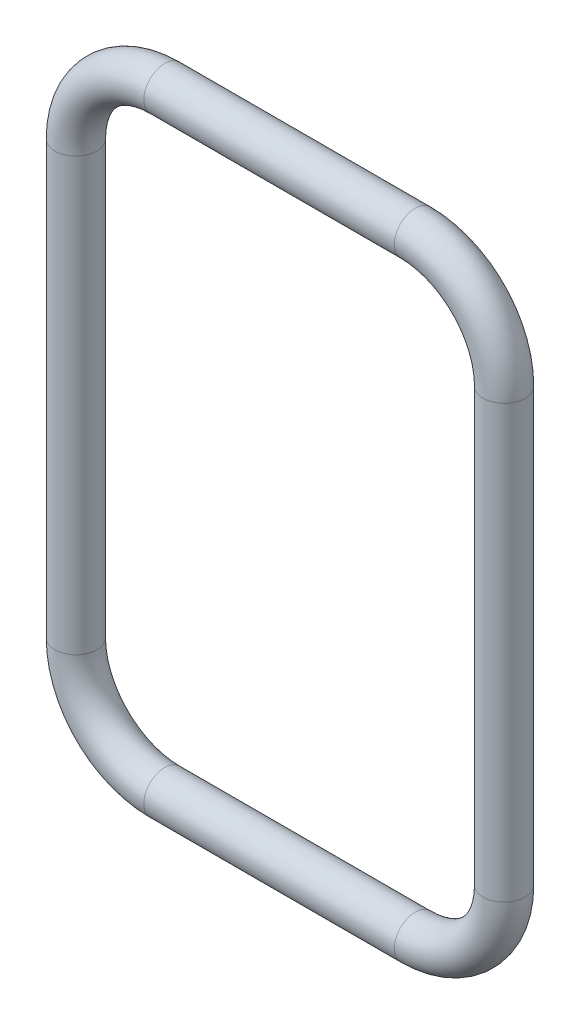
ISO-10303-21;
HEADER;
FILE_DESCRIPTION(('STEP AP214'),'2;1');
FILE_NAME('part.step','',(''),(''),'','','');
FILE_SCHEMA(('AUTOMOTIVE_DESIGN { 1 0 10303 214 1 1 1 1 }'));
ENDSEC;
DATA;
#1=APPLICATION_CONTEXT('core data for automotive mechanical design processes');
#2=APPLICATION_PROTOCOL_DEFINITION('international standard','automotive_design',2000,#1);
#3=PRODUCT_CONTEXT('',#1,'mechanical');
#4=PRODUCT('Part','Part','',(#3));
#5=PRODUCT_RELATED_PRODUCT_CATEGORY('part','',(#4));
#6=PRODUCT_DEFINITION_FORMATION('','',#4);
#7=PRODUCT_DEFINITION_CONTEXT('part definition',#1,'design');
#8=PRODUCT_DEFINITION('design','',#6,#7);
#9=PRODUCT_DEFINITION_SHAPE('','',#8);
#10=(LENGTH_UNIT() NAMED_UNIT(*) SI_UNIT(.MILLI.,.METRE.));
#11=(NAMED_UNIT(*) PLANE_ANGLE_UNIT() SI_UNIT($,.RADIAN.));
#12=(NAMED_UNIT(*) SI_UNIT($,.STERADIAN.) SOLID_ANGLE_UNIT());
#13=UNCERTAINTY_MEASURE_WITH_UNIT(LENGTH_MEASURE(1.E-05),#10,'distance_accuracy_value','');
#14=(GEOMETRIC_REPRESENTATION_CONTEXT(3) GLOBAL_UNCERTAINTY_ASSIGNED_CONTEXT((#13)) GLOBAL_UNIT_ASSIGNED_CONTEXT((#10,
#11,#12)) REPRESENTATION_CONTEXT('',''));
#15=CARTESIAN_POINT('',(0.,0.,0.));
#16=DIRECTION('',(0.,0.,1.));
#17=DIRECTION('',(1.,0.,0.));
#18=AXIS2_PLACEMENT_3D('',#15,#16,#17);
#19=CARTESIAN_POINT('',(-0.423042235172692,-0.729292571401342,2.7406541638193));
#20=DIRECTION('',(0.,0.,-1.));
#21=DIRECTION('',(0.,-1.,0.));
#22=AXIS2_PLACEMENT_3D('',#19,#20,#21);
#23=TOROIDAL_SURFACE('',#22,0.3,0.0707968085273034);
#24=CARTESIAN_POINT('',(-0.723042235172692,-0.729292571401342,2.7406541638193));
#25=DIRECTION('',(0.,-1.,0.));
#26=DIRECTION('',(1.,0.,0.));
#27=AXIS2_PLACEMENT_3D('',#24,#25,#26);
#28=CIRCLE('',#27,0.0707968085273034);
#29=CARTESIAN_POINT('',(-0.652245426645388,-0.729292571401342,2.7406541638193));
#30=VERTEX_POINT('',#29);
#31=CARTESIAN_POINT('',(-0.793839043699995,-0.729292571401342,2.7406541638193));
#32=VERTEX_POINT('',#31);
#33=EDGE_CURVE('E11',#30,#32,#28,.T.);
#34=ORIENTED_EDGE('',*,*,#33,.T.);
#35=CARTESIAN_POINT('',(-0.723042235172692,-0.729292571401342,2.7406541638193));
#36=DIRECTION('',(0.,-1.,0.));
#37=DIRECTION('',(1.,0.,0.));
#38=AXIS2_PLACEMENT_3D('',#35,#36,#37);
#39=CIRCLE('',#38,0.0707968085273034);
#40=EDGE_CURVE('E24',#32,#30,#39,.T.);
#41=ORIENTED_EDGE('',*,*,#40,.T.);
#42=CARTESIAN_POINT('',(-0.423042235172692,-0.729292571401342,2.7406541638193));
#43=DIRECTION('',(0.,0.,1.));
#44=DIRECTION('',(0.,-1.,0.));
#45=AXIS2_PLACEMENT_3D('',#42,#43,#44);
#46=CIRCLE('',#45,0.229203191472696);
#47=CARTESIAN_POINT('',(-0.423042235172691,-0.958495762874039,2.7406541638193));
#48=VERTEX_POINT('',#47);
#49=EDGE_CURVE('E133',#30,#48,#46,.T.);
#50=ORIENTED_EDGE('',*,*,#49,.T.);
#51=CARTESIAN_POINT('',(-0.423042235172691,-1.0292925714013,2.7406541638193));
#52=DIRECTION('',(-1.,0.,0.));
#53=DIRECTION('',(0.,1.,0.));
#54=AXIS2_PLACEMENT_3D('',#51,#52,#53);
#55=CIRCLE('',#54,0.0707968085273034);
#56=CARTESIAN_POINT('',(-0.423042235172691,-1.1000893799287,2.7406541638193));
#57=VERTEX_POINT('',#56);
#58=EDGE_CURVE('E131',#48,#57,#55,.T.);
#59=ORIENTED_EDGE('',*,*,#58,.T.);
#60=CARTESIAN_POINT('',(-0.423042235172691,-1.0292925714013,2.7406541638193));
#61=DIRECTION('',(-1.,0.,0.));
#62=DIRECTION('',(0.,1.,0.));
#63=AXIS2_PLACEMENT_3D('',#60,#61,#62);
#64=CIRCLE('',#63,0.0707968085273034);
#65=EDGE_CURVE('E128',#57,#48,#64,.T.);
#66=ORIENTED_EDGE('',*,*,#65,.T.);
#67=ORIENTED_EDGE('',*,*,#49,.F.);
#68=EDGE_LOOP('',(#34,#41,#50,#59,#66,#67));
#69=FACE_BOUND('',#68,.T.);
#70=ADVANCED_FACE('F17',(#69),#23,.T.);
#71=CARTESIAN_POINT('',(0.423042235172693,-1.0292925714013,2.7406541638193));
#72=DIRECTION('',(-1.,0.,0.));
#73=DIRECTION('',(0.,1.,0.));
#74=AXIS2_PLACEMENT_3D('',#71,#72,#73);
#75=CYLINDRICAL_SURFACE('',#74,0.0707968085273034);
#76=ORIENTED_EDGE('',*,*,#58,.F.);
#77=ORIENTED_EDGE('',*,*,#65,.F.);
#78=DIRECTION('',(1.,0.,0.));
#79=VECTOR('',#78,1.);
#80=CARTESIAN_POINT('',(0.423042235172693,-1.1000893799287,2.7406541638193));
#81=LINE('',#80,#79);
#82=CARTESIAN_POINT('',(0.423042235172693,-1.1000893799287,2.7406541638193));
#83=VERTEX_POINT('',#82);
#84=EDGE_CURVE('E126',#57,#83,#81,.T.);
#85=ORIENTED_EDGE('',*,*,#84,.T.);
#86=CARTESIAN_POINT('',(0.423042235172693,-1.0292925714013,2.7406541638193));
#87=DIRECTION('',(-1.,0.,0.));
#88=DIRECTION('',(0.,1.,0.));
#89=AXIS2_PLACEMENT_3D('',#86,#87,#88);
#90=CIRCLE('',#89,0.0707968085273034);
#91=CARTESIAN_POINT('',(0.423042235172693,-0.958495762874038,2.7406541638193));
#92=VERTEX_POINT('',#91);
#93=EDGE_CURVE('E124',#83,#92,#90,.T.);
#94=ORIENTED_EDGE('',*,*,#93,.T.);
#95=CARTESIAN_POINT('',(0.423042235172693,-1.0292925714013,2.7406541638193));
#96=DIRECTION('',(-1.,0.,0.));
#97=DIRECTION('',(0.,1.,0.));
#98=AXIS2_PLACEMENT_3D('',#95,#96,#97);
#99=CIRCLE('',#98,0.0707968085273034);
#100=EDGE_CURVE('E121',#92,#83,#99,.T.);
#101=ORIENTED_EDGE('',*,*,#100,.T.);
#102=ORIENTED_EDGE('',*,*,#84,.F.);
#103=EDGE_LOOP('',(#76,#77,#85,#94,#101,#102));
#104=FACE_BOUND('',#103,.T.);
#105=ADVANCED_FACE('F138',(#104),#75,.T.);
#106=CARTESIAN_POINT('',(0.423042235172692,-0.729292571401342,2.7406541638193));
#107=DIRECTION('',(0.,0.,-1.));
#108=DIRECTION('',(-1.,0.,0.));
#109=AXIS2_PLACEMENT_3D('',#106,#107,#108);
#110=TOROIDAL_SURFACE('',#109,0.3,0.0707968085273034);
#111=ORIENTED_EDGE('',*,*,#100,.F.);
#112=CARTESIAN_POINT('',(0.423042235172692,-0.729292571401342,2.7406541638193));
#113=DIRECTION('',(0.,0.,1.));
#114=DIRECTION('',(-1.,0.,0.));
#115=AXIS2_PLACEMENT_3D('',#112,#113,#114);
#116=CIRCLE('',#115,0.229203191472696);
#117=CARTESIAN_POINT('',(0.652245426645388,-0.729292571401341,2.7406541638193));
#118=VERTEX_POINT('',#117);
#119=EDGE_CURVE('E119',#92,#118,#116,.T.);
#120=ORIENTED_EDGE('',*,*,#119,.T.);
#121=CARTESIAN_POINT('',(0.723042235172692,-0.729292571401341,2.7406541638193));
#122=DIRECTION('',(0.,-1.,0.));
#123=DIRECTION('',(-1.,0.,0.));
#124=AXIS2_PLACEMENT_3D('',#121,#122,#123);
#125=CIRCLE('',#124,0.0707968085273034);
#126=CARTESIAN_POINT('',(0.793839043699995,-0.729292571401341,2.7406541638193));
#127=VERTEX_POINT('',#126);
#128=EDGE_CURVE('E117',#118,#127,#125,.T.);
#129=ORIENTED_EDGE('',*,*,#128,.T.);
#130=CARTESIAN_POINT('',(0.723042235172692,-0.729292571401341,2.7406541638193));
#131=DIRECTION('',(0.,-1.,0.));
#132=DIRECTION('',(-1.,0.,0.));
#133=AXIS2_PLACEMENT_3D('',#130,#131,#132);
#134=CIRCLE('',#133,0.0707968085273034);
#135=EDGE_CURVE('E114',#127,#118,#134,.T.);
#136=ORIENTED_EDGE('',*,*,#135,.T.);
#137=ORIENTED_EDGE('',*,*,#119,.F.);
#138=ORIENTED_EDGE('',*,*,#93,.F.);
#139=EDGE_LOOP('',(#111,#120,#129,#136,#137,#138));
#140=FACE_BOUND('',#139,.T.);
#141=ADVANCED_FACE('F143',(#140),#110,.T.);
#142=CARTESIAN_POINT('',(0.723042235172692,0.729292571401343,2.7406541638193));
#143=DIRECTION('',(0.,-1.,0.));
#144=DIRECTION('',(-1.,0.,0.));
#145=AXIS2_PLACEMENT_3D('',#142,#143,#144);
#146=CYLINDRICAL_SURFACE('',#145,0.0707968085273034);
#147=ORIENTED_EDGE('',*,*,#128,.F.);
#148=ORIENTED_EDGE('',*,*,#135,.F.);
#149=DIRECTION('',(0.,1.,0.));
#150=VECTOR('',#149,1.);
#151=CARTESIAN_POINT('',(0.793839043699995,0.729292571401343,2.7406541638193));
#152=LINE('',#151,#150);
#153=CARTESIAN_POINT('',(0.793839043699995,0.729292571401343,2.7406541638193));
#154=VERTEX_POINT('',#153);
#155=EDGE_CURVE('E112',#127,#154,#152,.T.);
#156=ORIENTED_EDGE('',*,*,#155,.T.);
#157=CARTESIAN_POINT('',(0.723042235172692,0.729292571401343,2.7406541638193));
#158=DIRECTION('',(0.,-1.,0.));
#159=DIRECTION('',(-1.,0.,0.));
#160=AXIS2_PLACEMENT_3D('',#157,#158,#159);
#161=CIRCLE('',#160,0.0707968085273034);
#162=CARTESIAN_POINT('',(0.652245426645388,0.729292571401343,2.7406541638193));
#163=VERTEX_POINT('',#162);
#164=EDGE_CURVE('E110',#154,#163,#161,.T.);
#165=ORIENTED_EDGE('',*,*,#164,.T.);
#166=CARTESIAN_POINT('',(0.723042235172692,0.729292571401343,2.7406541638193));
#167=DIRECTION('',(0.,-1.,0.));
#168=DIRECTION('',(-1.,0.,0.));
#169=AXIS2_PLACEMENT_3D('',#166,#167,#168);
#170=CIRCLE('',#169,0.0707968085273034);
#171=EDGE_CURVE('E107',#163,#154,#170,.T.);
#172=ORIENTED_EDGE('',*,*,#171,.T.);
#173=ORIENTED_EDGE('',*,*,#155,.F.);
#174=EDGE_LOOP('',(#147,#148,#156,#165,#172,#173));
#175=FACE_BOUND('',#174,.T.);
#176=ADVANCED_FACE('F148',(#175),#146,.T.);
#177=CARTESIAN_POINT('',(0.423042235172692,0.729292571401342,2.7406541638193));
#178=DIRECTION('',(0.,0.,-1.));
#179=DIRECTION('',(-1.,0.,0.));
#180=AXIS2_PLACEMENT_3D('',#177,#178,#179);
#181=TOROIDAL_SURFACE('',#180,0.3,0.0707968085273034);
#182=ORIENTED_EDGE('',*,*,#171,.F.);
#183=CARTESIAN_POINT('',(0.423042235172692,0.729292571401342,2.7406541638193));
#184=DIRECTION('',(0.,0.,1.));
#185=DIRECTION('',(-1.,0.,0.));
#186=AXIS2_PLACEMENT_3D('',#183,#184,#185);
#187=CIRCLE('',#186,0.229203191472696);
#188=CARTESIAN_POINT('',(0.423042235172691,0.958495762874039,2.7406541638193));
#189=VERTEX_POINT('',#188);
#190=EDGE_CURVE('E105',#163,#189,#187,.T.);
#191=ORIENTED_EDGE('',*,*,#190,.T.);
#192=CARTESIAN_POINT('',(0.423042235172691,1.0292925714013,2.7406541638193));
#193=DIRECTION('',(1.,0.,0.));
#194=DIRECTION('',(0.,-1.,0.));
#195=AXIS2_PLACEMENT_3D('',#192,#193,#194);
#196=CIRCLE('',#195,0.0707968085273034);
#197=CARTESIAN_POINT('',(0.423042235172691,1.1000893799287,2.7406541638193));
#198=VERTEX_POINT('',#197);
#199=EDGE_CURVE('E103',#189,#198,#196,.T.);
#200=ORIENTED_EDGE('',*,*,#199,.T.);
#201=CARTESIAN_POINT('',(0.423042235172691,1.0292925714013,2.7406541638193));
#202=DIRECTION('',(1.,0.,0.));
#203=DIRECTION('',(0.,-1.,0.));
#204=AXIS2_PLACEMENT_3D('',#201,#202,#203);
#205=CIRCLE('',#204,0.0707968085273034);
#206=EDGE_CURVE('E100',#198,#189,#205,.T.);
#207=ORIENTED_EDGE('',*,*,#206,.T.);
#208=ORIENTED_EDGE('',*,*,#190,.F.);
#209=ORIENTED_EDGE('',*,*,#164,.F.);
#210=EDGE_LOOP('',(#182,#191,#200,#207,#208,#209));
#211=FACE_BOUND('',#210,.T.);
#212=ADVANCED_FACE('F153',(#211),#181,.T.);
#213=CARTESIAN_POINT('',(-0.423042235172692,1.0292925714013,2.7406541638193));
#214=DIRECTION('',(1.,0.,0.));
#215=DIRECTION('',(0.,-1.,0.));
#216=AXIS2_PLACEMENT_3D('',#213,#214,#215);
#217=CYLINDRICAL_SURFACE('',#216,0.0707968085273034);
#218=ORIENTED_EDGE('',*,*,#199,.F.);
#219=ORIENTED_EDGE('',*,*,#206,.F.);
#220=DIRECTION('',(-1.,0.,0.));
#221=VECTOR('',#220,1.);
#222=CARTESIAN_POINT('',(-0.423042235172692,1.1000893799286,2.7406541638193));
#223=LINE('',#222,#221);
#224=CARTESIAN_POINT('',(-0.423042235172692,1.1000893799286,2.7406541638193));
#225=VERTEX_POINT('',#224);
#226=EDGE_CURVE('E98',#198,#225,#223,.T.);
#227=ORIENTED_EDGE('',*,*,#226,.T.);
#228=CARTESIAN_POINT('',(-0.423042235172692,1.0292925714013,2.7406541638193));
#229=DIRECTION('',(1.,0.,0.));
#230=DIRECTION('',(0.,-1.,0.));
#231=AXIS2_PLACEMENT_3D('',#228,#229,#230);
#232=CIRCLE('',#231,0.0707968085273034);
#233=CARTESIAN_POINT('',(-0.423042235172692,0.958495762874038,2.7406541638193));
#234=VERTEX_POINT('',#233);
#235=EDGE_CURVE('E96',#225,#234,#232,.T.);
#236=ORIENTED_EDGE('',*,*,#235,.T.);
#237=CARTESIAN_POINT('',(-0.423042235172692,1.0292925714013,2.7406541638193));
#238=DIRECTION('',(1.,0.,0.));
#239=DIRECTION('',(0.,-1.,0.));
#240=AXIS2_PLACEMENT_3D('',#237,#238,#239);
#241=CIRCLE('',#240,0.0707968085273034);
#242=EDGE_CURVE('E93',#234,#225,#241,.T.);
#243=ORIENTED_EDGE('',*,*,#242,.T.);
#244=ORIENTED_EDGE('',*,*,#226,.F.);
#245=EDGE_LOOP('',(#218,#219,#227,#236,#243,#244));
#246=FACE_BOUND('',#245,.T.);
#247=ADVANCED_FACE('F158',(#246),#217,.T.);
#248=CARTESIAN_POINT('',(-0.423042235172692,0.729292571401342,2.7406541638193));
#249=DIRECTION('',(0.,0.,-1.));
#250=DIRECTION('',(-1.,0.,0.));
#251=AXIS2_PLACEMENT_3D('',#248,#249,#250);
#252=TOROIDAL_SURFACE('',#251,0.3,0.0707968085273034);
#253=ORIENTED_EDGE('',*,*,#242,.F.);
#254=CARTESIAN_POINT('',(-0.423042235172692,0.729292571401342,2.7406541638193));
#255=DIRECTION('',(0.,0.,1.));
#256=DIRECTION('',(-1.,0.,0.));
#257=AXIS2_PLACEMENT_3D('',#254,#255,#256);
#258=CIRCLE('',#257,0.229203191472696);
#259=CARTESIAN_POINT('',(-0.652245426645388,0.729292571401342,2.7406541638193));
#260=VERTEX_POINT('',#259);
#261=EDGE_CURVE('E84',#234,#260,#258,.T.);
#262=ORIENTED_EDGE('',*,*,#261,.T.);
#263=CARTESIAN_POINT('',(-0.723042235172692,0.729292571401342,2.7406541638193));
#264=DIRECTION('',(0.,1.,0.));
#265=DIRECTION('',(1.,0.,0.));
#266=AXIS2_PLACEMENT_3D('',#263,#264,#265);
#267=CIRCLE('',#266,0.0707968085273034);
#268=CARTESIAN_POINT('',(-0.793839043699995,0.729292571401342,2.7406541638193));
#269=VERTEX_POINT('',#268);
#270=EDGE_CURVE('E78',#260,#269,#267,.T.);
#271=ORIENTED_EDGE('',*,*,#270,.T.);
#272=CARTESIAN_POINT('',(-0.723042235172692,0.729292571401342,2.7406541638193));
#273=DIRECTION('',(0.,1.,0.));
#274=DIRECTION('',(1.,0.,0.));
#275=AXIS2_PLACEMENT_3D('',#272,#273,#274);
#276=CIRCLE('',#275,0.0707968085273034);
#277=EDGE_CURVE('E83',#269,#260,#276,.T.);
#278=ORIENTED_EDGE('',*,*,#277,.T.);
#279=ORIENTED_EDGE('',*,*,#261,.F.);
#280=ORIENTED_EDGE('',*,*,#235,.F.);
#281=EDGE_LOOP('',(#253,#262,#271,#278,#279,#280));
#282=FACE_BOUND('',#281,.T.);
#283=ADVANCED_FACE('F81',(#282),#252,.T.);
#284=CARTESIAN_POINT('',(-0.723042235172692,-0.729292571401342,2.7406541638193));
#285=DIRECTION('',(0.,1.,0.));
#286=DIRECTION('',(1.,0.,0.));
#287=AXIS2_PLACEMENT_3D('',#284,#285,#286);
#288=CYLINDRICAL_SURFACE('',#287,0.0707968085273034);
#289=ORIENTED_EDGE('',*,*,#270,.F.);
#290=ORIENTED_EDGE('',*,*,#277,.F.);
#291=DIRECTION('',(0.,-1.,0.));
#292=VECTOR('',#291,1.);
#293=CARTESIAN_POINT('',(-0.793839043699995,-0.729292571401342,2.7406541638193));
#294=LINE('',#293,#292);
#295=EDGE_CURVE('E88',#269,#32,#294,.T.);
#296=ORIENTED_EDGE('',*,*,#295,.T.);
#297=ORIENTED_EDGE('',*,*,#33,.F.);
#298=ORIENTED_EDGE('',*,*,#40,.F.);
#299=ORIENTED_EDGE('',*,*,#295,.F.);
#300=EDGE_LOOP('',(#289,#290,#296,#297,#298,#299));
#301=FACE_BOUND('',#300,.T.);
#302=ADVANCED_FACE('F87',(#301),#288,.T.);
#303=CLOSED_SHELL('',(#70,#105,#141,#176,#212,#247,#283,#302));
#304=MANIFOLD_SOLID_BREP('B1',#303);
#305=ADVANCED_BREP_SHAPE_REPRESENTATION('',(#18,#304),#14);
#306=SHAPE_DEFINITION_REPRESENTATION(#9,#305);
ENDSEC;
END-ISO-10303-21;
